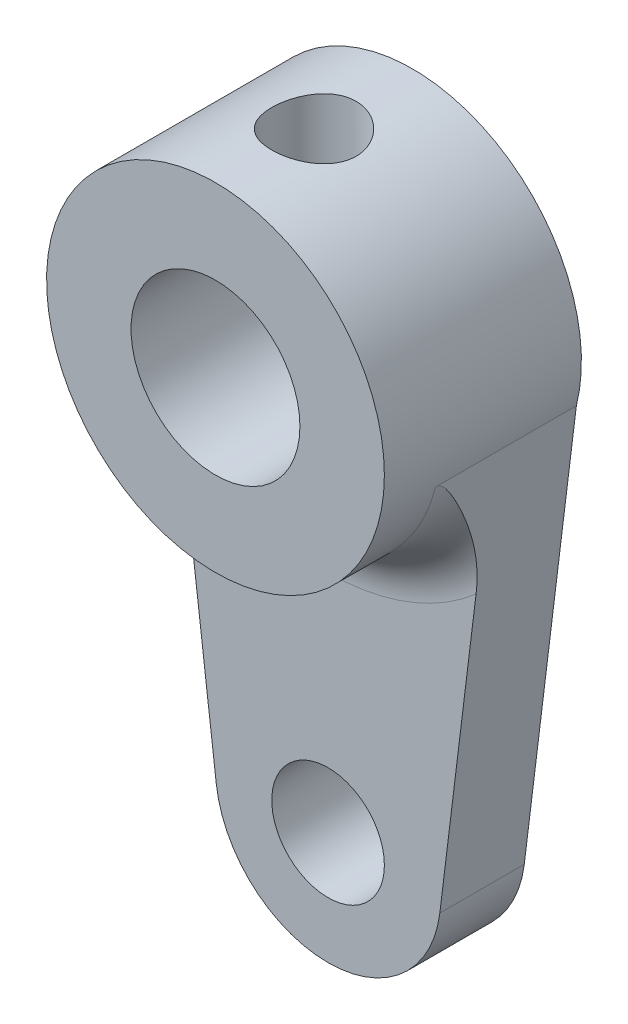
ISO-10303-21;
HEADER;
FILE_DESCRIPTION(('STEP AP214'),'2;1');
FILE_NAME('part.step','',(''),(''),'','','');
FILE_SCHEMA(('AUTOMOTIVE_DESIGN { 1 0 10303 214 1 1 1 1 }'));
ENDSEC;
DATA;
#1=APPLICATION_CONTEXT('core data for automotive mechanical design processes');
#2=APPLICATION_PROTOCOL_DEFINITION('international standard','automotive_design',2000,#1);
#3=PRODUCT_CONTEXT('',#1,'mechanical');
#4=PRODUCT('Part','Part','',(#3));
#5=PRODUCT_RELATED_PRODUCT_CATEGORY('part','',(#4));
#6=PRODUCT_DEFINITION_FORMATION('','',#4);
#7=PRODUCT_DEFINITION_CONTEXT('part definition',#1,'design');
#8=PRODUCT_DEFINITION('design','',#6,#7);
#9=PRODUCT_DEFINITION_SHAPE('','',#8);
#10=(LENGTH_UNIT() NAMED_UNIT(*) SI_UNIT(.MILLI.,.METRE.));
#11=(NAMED_UNIT(*) PLANE_ANGLE_UNIT() SI_UNIT($,.RADIAN.));
#12=(NAMED_UNIT(*) SI_UNIT($,.STERADIAN.) SOLID_ANGLE_UNIT());
#13=UNCERTAINTY_MEASURE_WITH_UNIT(LENGTH_MEASURE(1.E-05),#10,'distance_accuracy_value','');
#14=(GEOMETRIC_REPRESENTATION_CONTEXT(3) GLOBAL_UNCERTAINTY_ASSIGNED_CONTEXT((#13)) GLOBAL_UNIT_ASSIGNED_CONTEXT((#10,
#11,#12)) REPRESENTATION_CONTEXT('',''));
#15=CARTESIAN_POINT('',(0.,0.,0.));
#16=DIRECTION('',(0.,0.,1.));
#17=DIRECTION('',(1.,0.,0.));
#18=AXIS2_PLACEMENT_3D('',#15,#16,#17);
#19=CARTESIAN_POINT('',(0.,0.,7.));
#20=DIRECTION('',(0.,0.,-1.));
#21=DIRECTION('',(-1.,0.,0.));
#22=AXIS2_PLACEMENT_3D('',#19,#20,#21);
#23=CYLINDRICAL_SURFACE('',#22,6.);
#24=CARTESIAN_POINT('',(0.,6.,4.99999999999999));
#25=CARTESIAN_POINT('',(-0.0828760886697317,5.99999859868013,4.99999767426184));
#26=CARTESIAN_POINT('',(-0.165778157830763,5.99826578131828,4.99310844922621));
#27=CARTESIAN_POINT('',(-0.329206323770532,5.99152113829892,4.96577484869299));
#28=CARTESIAN_POINT('',(-0.409731046870738,5.98650745419968,4.94532279046215));
#29=CARTESIAN_POINT('',(-0.566020872182576,5.9737562633204,4.89156074653791));
#30=CARTESIAN_POINT('',(-0.641791563430001,5.96602202842087,4.85826620128472));
#31=CARTESIAN_POINT('',(-0.786672131904424,5.94865343807593,4.77981860995516));
#32=CARTESIAN_POINT('',(-0.855781784348756,5.9390190185405,4.73466516388106));
#33=CARTESIAN_POINT('',(-0.986801927300916,5.91867413591801,4.63279921034578));
#34=CARTESIAN_POINT('',(-1.04855569006107,5.90794707148533,4.57588842504082));
#35=CARTESIAN_POINT('',(-1.1617489272033,5.8867362011753,4.45254779509108));
#36=CARTESIAN_POINT('',(-1.21318723694913,5.87625242288349,4.3861168770535));
#37=CARTESIAN_POINT('',(-1.30502654279903,5.8565477569971,4.24440477326256));
#38=CARTESIAN_POINT('',(-1.34525221592535,5.84734794470605,4.16900676918959));
#39=CARTESIAN_POINT('',(-1.41239690855052,5.83149494812223,4.01225158834164));
#40=CARTESIAN_POINT('',(-1.43931805543933,5.82484135672789,3.93089536667424));
#41=CARTESIAN_POINT('',(-1.47855483680428,5.81500476717551,3.76625650179753));
#42=CARTESIAN_POINT('',(-1.49115226833333,5.81175491075426,3.6830451039502));
#43=CARTESIAN_POINT('',(-1.50226177506785,5.80889362537741,3.51563143098602));
#44=CARTESIAN_POINT('',(-1.50077614181797,5.80928160448644,3.43142931930139));
#45=CARTESIAN_POINT('',(-1.48398652463927,5.81359205496618,3.26658419225552));
#46=CARTESIAN_POINT('',(-1.46901834019051,5.81742863001879,3.1859043785349));
#47=CARTESIAN_POINT('',(-1.4262241869031,5.82806709676484,3.02823894908871));
#48=CARTESIAN_POINT('',(-1.39839730206942,5.83486919970697,2.95125359697102));
#49=CARTESIAN_POINT('',(-1.33038947793715,5.85075113904187,2.80226198374794));
#50=CARTESIAN_POINT('',(-1.29008666723291,5.85985327469421,2.73031382821045));
#51=CARTESIAN_POINT('',(-1.19835627601495,5.87929710846386,2.59408129024317));
#52=CARTESIAN_POINT('',(-1.14692674880884,5.88963902334735,2.52979825193275));
#53=CARTESIAN_POINT('',(-1.03266342468121,5.91075880539781,2.40879638430561));
#54=CARTESIAN_POINT('',(-0.969546258165856,5.92154069477971,2.35234550993865));
#55=CARTESIAN_POINT('',(-0.834611917503697,5.94205965578786,2.2507787575361));
#56=CARTESIAN_POINT('',(-0.762794477707941,5.95179669549415,2.20566322573644));
#57=CARTESIAN_POINT('',(-0.61211588868139,5.96917732094183,2.12794941377562));
#58=CARTESIAN_POINT('',(-0.533231393208622,5.97681360127725,2.09539465974558));
#59=CARTESIAN_POINT('',(-0.370876008142882,5.98907916991419,2.04408269429043));
#60=CARTESIAN_POINT('',(-0.287405999150484,5.99370903339281,2.02532284358187));
#61=CARTESIAN_POINT('',(-0.120539970390027,5.99935499271375,2.00254243444117));
#62=CARTESIAN_POINT('',(-0.03719671998821,6.00046053508279,1.99815697392471));
#63=CARTESIAN_POINT('',(0.129032874801507,5.99918804814451,2.00324900205549));
#64=CARTESIAN_POINT('',(0.211919259644594,5.99681033241847,2.01272524279914));
#65=CARTESIAN_POINT('',(0.373614268776489,5.98889581127357,2.04497090839139));
#66=CARTESIAN_POINT('',(0.452465118968752,5.98340634185811,2.06754126347699));
#67=CARTESIAN_POINT('',(0.605257292452508,5.96988706634134,2.12510708402845));
#68=CARTESIAN_POINT('',(0.679198119032631,5.96185700369892,2.16010380431318));
#69=CARTESIAN_POINT('',(0.821523134429843,5.9439330792631,2.24223612887473));
#70=CARTESIAN_POINT('',(0.889785441835826,5.93400867366932,2.28957611239677));
#71=CARTESIAN_POINT('',(1.01752661364324,5.91344509187419,2.39478990879698));
#72=CARTESIAN_POINT('',(1.077003958973,5.90280579251705,2.45266553961691));
#73=CARTESIAN_POINT('',(1.18699056807272,5.88168956960771,2.57900196084447));
#74=CARTESIAN_POINT('',(1.23724386762203,5.87122304187281,2.64768770300243));
#75=CARTESIAN_POINT('',(1.32551075901269,5.85192878377239,2.79273263446572));
#76=CARTESIAN_POINT('',(1.36352489415793,5.84310098067026,2.86909148295976));
#77=CARTESIAN_POINT('',(1.42595142060928,5.82818094734665,3.02690572241308));
#78=CARTESIAN_POINT('',(1.45044439665406,5.82207255291906,3.10832762834401));
#79=CARTESIAN_POINT('',(1.48534565995377,5.81326744090184,3.27430963788911));
#80=CARTESIAN_POINT('',(1.49575702747865,5.81056997719936,3.35886905103249));
#81=CARTESIAN_POINT('',(1.50203859033399,5.80894901203957,3.5261210238552));
#82=CARTESIAN_POINT('',(1.49831789778011,5.80991932728264,3.60879743512473));
#83=CARTESIAN_POINT('',(1.47737727831286,5.81527909007843,3.77230388866798));
#84=CARTESIAN_POINT('',(1.46015762268676,5.81966846891857,3.85313396801365));
#85=CARTESIAN_POINT('',(1.41293131944279,5.83131260682723,4.01020845906541));
#86=CARTESIAN_POINT('',(1.38300140468037,5.8385501523631,4.08647730524021));
#87=CARTESIAN_POINT('',(1.31126491360506,5.85507755724829,4.23296538271369));
#88=CARTESIAN_POINT('',(1.26945669003418,5.86436770120773,4.30318377318691));
#89=CARTESIAN_POINT('',(1.17386774863713,5.88425634263512,4.43755462900202));
#90=CARTESIAN_POINT('',(1.11980316291225,5.89488264831757,4.50150107342396));
#91=CARTESIAN_POINT('',(1.00178937118973,5.91608027246286,4.6195470447954));
#92=CARTESIAN_POINT('',(0.93783782126114,5.9266515772706,4.67364423011296));
#93=CARTESIAN_POINT('',(0.800467586702585,5.94677655647663,4.7714113085646));
#94=CARTESIAN_POINT('',(0.726898422316382,5.95630833365868,4.81487461367157));
#95=CARTESIAN_POINT('',(0.573266059510472,5.97304924975119,4.88874746294052));
#96=CARTESIAN_POINT('',(0.493207563436735,5.98026005199781,4.91916636064853));
#97=CARTESIAN_POINT('',(0.344410253243468,5.99048059565542,4.96157183032965));
#98=CARTESIAN_POINT('',(0.276380170908066,5.99402585052691,4.97595124305343));
#99=CARTESIAN_POINT('',(0.138906071536281,5.99878605231948,4.99516594362194));
#100=CARTESIAN_POINT('',(0.069462161242615,6.00000117450894,5.0000019493053));
#101=CARTESIAN_POINT('',(0.,6.,4.99999999999999));
#102=B_SPLINE_CURVE_WITH_KNOTS('',3,(#24,#25,#26,#27,#28,#29,#30,#31,#32,#33,#34,#35,#36,#37,
#38,#39,#40,#41,#42,#43,#44,#45,#46,#47,#48,#49,#50,#51,#52,#53,#54,#55,#56,#57,#58,#59,#60,#61,
#62,#63,#64,#65,#66,#67,#68,#69,#70,#71,#72,#73,#74,#75,#76,#77,#78,#79,#80,#81,#82,#83,#84,#85,
#86,#87,#88,#89,#90,#91,#92,#93,#94,#95,#96,#97,#98,#99,#100,#101),.UNSPECIFIED.,.T.,.F.,(4,2,2,
2,2,2,2,2,2,2,2,2,2,2,2,2,2,2,2,2,2,2,2,2,2,2,2,2,2,2,2,2,2,2,2,2,2,2,4),(0.,0.248373712471889,
0.496888237763897,0.745104902286103,0.993329940169324,1.24614435437139,1.49898729580061,
1.75558647545806,2.01214461169367,2.26356295099429,2.51494038112696,2.76022497007017,
3.00552703466037,3.25330527873878,3.50112690836161,3.75601500969018,4.01091089558245,
4.26668229009112,4.52240473688641,4.77158308949274,5.02073901112741,5.26620274514035,
5.51169127322288,5.76153587565349,6.01142363008016,6.26744509204473,6.52345518749505,
6.77792254614033,7.03233423252405,7.27943780398609,7.52653640956031,7.77216400559444,
8.01782568136898,8.26989576409907,8.52202569770414,8.77872185499584,9.03523363821346,
9.24342242942145,9.45159556043036),.UNSPECIFIED.);
#103=CARTESIAN_POINT('',(0.,6.,4.99999999999999));
#104=VERTEX_POINT('',#103);
#105=EDGE_CURVE('E110',#104,#104,#102,.T.);
#106=ORIENTED_EDGE('',*,*,#105,.T.);
#107=EDGE_LOOP('',(#106));
#108=FACE_BOUND('',#107,.T.);
#109=CARTESIAN_POINT('',(0.,0.,7.));
#110=DIRECTION('',(0.,0.,1.));
#111=DIRECTION('',(1.,0.,0.));
#112=AXIS2_PLACEMENT_3D('',#109,#110,#111);
#113=CIRCLE('',#112,6.);
#114=CARTESIAN_POINT('',(6.,0.,7.));
#115=VERTEX_POINT('',#114);
#116=EDGE_CURVE('E199',#115,#115,#113,.T.);
#117=ORIENTED_EDGE('',*,*,#116,.F.);
#118=EDGE_LOOP('',(#117));
#119=FACE_BOUND('',#118,.T.);
#120=CARTESIAN_POINT('',(0.,0.,5.));
#121=DIRECTION('',(0.,0.,1.));
#122=DIRECTION('',(1.,0.,0.));
#123=AXIS2_PLACEMENT_3D('',#120,#121,#122);
#124=CIRCLE('',#123,6.);
#125=CARTESIAN_POINT('',(-5.82083518297647,-1.45529301950613,5.));
#126=VERTEX_POINT('',#125);
#127=CARTESIAN_POINT('',(5.82083518297647,-1.45529301950613,5.));
#128=VERTEX_POINT('',#127);
#129=EDGE_CURVE('E202',#126,#128,#124,.T.);
#130=ORIENTED_EDGE('',*,*,#129,.T.);
#131=DIRECTION('',(0.,0.,-1.));
#132=VECTOR('',#131,1.);
#133=CARTESIAN_POINT('',(5.82083518297647,-1.45529301950613,3.));
#134=LINE('',#133,#132);
#135=CARTESIAN_POINT('',(5.82083518297647,-1.45529301950613,0.));
#136=VERTEX_POINT('',#135);
#137=EDGE_CURVE('E172',#128,#136,#134,.T.);
#138=ORIENTED_EDGE('',*,*,#137,.T.);
#139=CARTESIAN_POINT('',(0.,0.,0.));
#140=DIRECTION('',(0.,0.,1.));
#141=DIRECTION('',(1.,0.,0.));
#142=AXIS2_PLACEMENT_3D('',#139,#140,#141);
#143=CIRCLE('',#142,6.);
#144=CARTESIAN_POINT('',(-5.82083518297647,-1.45529301950613,0.));
#145=VERTEX_POINT('',#144);
#146=EDGE_CURVE('E171',#136,#145,#143,.T.);
#147=ORIENTED_EDGE('',*,*,#146,.T.);
#148=DIRECTION('',(0.,0.,-1.));
#149=VECTOR('',#148,1.);
#150=CARTESIAN_POINT('',(-5.82083518297647,-1.45529301950613,3.));
#151=LINE('',#150,#149);
#152=EDGE_CURVE('E194',#126,#145,#151,.T.);
#153=ORIENTED_EDGE('',*,*,#152,.F.);
#154=EDGE_LOOP('',(#130,#138,#147,#153));
#155=FACE_BOUND('',#154,.T.);
#156=ADVANCED_FACE('F105',(#108,#119,#155),#23,.T.);
#157=CARTESIAN_POINT('',(0.,0.,7.));
#158=DIRECTION('',(0.,0.,1.));
#159=DIRECTION('',(1.,0.,0.));
#160=AXIS2_PLACEMENT_3D('',#157,#158,#159);
#161=PLANE('',#160);
#162=CARTESIAN_POINT('',(0.,0.,7.));
#163=DIRECTION('',(0.,0.,1.));
#164=DIRECTION('',(1.,0.,0.));
#165=AXIS2_PLACEMENT_3D('',#162,#163,#164);
#166=CIRCLE('',#165,3.);
#167=CARTESIAN_POINT('',(3.,0.,7.));
#168=VERTEX_POINT('',#167);
#169=EDGE_CURVE('E187',#168,#168,#166,.T.);
#170=ORIENTED_EDGE('',*,*,#169,.F.);
#171=EDGE_LOOP('',(#170));
#172=FACE_BOUND('',#171,.T.);
#173=ORIENTED_EDGE('',*,*,#116,.T.);
#174=EDGE_LOOP('',(#173));
#175=FACE_BOUND('',#174,.T.);
#176=ADVANCED_FACE('F230',(#172,#175),#161,.T.);
#177=CARTESIAN_POINT('',(0.,0.,0.));
#178=DIRECTION('',(0.,0.,1.));
#179=DIRECTION('',(1.,0.,0.));
#180=AXIS2_PLACEMENT_3D('',#177,#178,#179);
#181=PLANE('',#180);
#182=CARTESIAN_POINT('',(0.,0.,0.));
#183=DIRECTION('',(0.,0.,1.));
#184=DIRECTION('',(1.,0.,0.));
#185=AXIS2_PLACEMENT_3D('',#182,#183,#184);
#186=CIRCLE('',#185,3.);
#187=CARTESIAN_POINT('',(3.,0.,0.));
#188=VERTEX_POINT('',#187);
#189=EDGE_CURVE('E280',#188,#188,#186,.T.);
#190=ORIENTED_EDGE('',*,*,#189,.T.);
#191=EDGE_LOOP('',(#190));
#192=FACE_BOUND('',#191,.T.);
#193=ORIENTED_EDGE('',*,*,#146,.F.);
#194=DIRECTION('',(-0.122190021763757,-0.992506724703351,0.));
#195=VECTOR('',#194,1.);
#196=CARTESIAN_POINT('',(5.91041759148824,-0.727646509753063,0.));
#197=LINE('',#196,#195);
#198=CARTESIAN_POINT('',(3.9700268988134,-16.488760087055,0.));
#199=VERTEX_POINT('',#198);
#200=EDGE_CURVE('E189',#136,#199,#197,.T.);
#201=ORIENTED_EDGE('',*,*,#200,.T.);
#202=CARTESIAN_POINT('',(0.,-16.,0.));
#203=DIRECTION('',(0.,0.,1.));
#204=DIRECTION('',(1.,0.,0.));
#205=AXIS2_PLACEMENT_3D('',#202,#203,#204);
#206=CIRCLE('',#205,4.);
#207=CARTESIAN_POINT('',(-3.9700268988134,-16.488760087055,0.));
#208=VERTEX_POINT('',#207);
#209=EDGE_CURVE('E169',#199,#208,#206,.F.);
#210=ORIENTED_EDGE('',*,*,#209,.T.);
#211=DIRECTION('',(-0.122190021763757,0.992506724703351,0.));
#212=VECTOR('',#211,1.);
#213=CARTESIAN_POINT('',(-5.91041759148824,-0.727646509753063,0.));
#214=LINE('',#213,#212);
#215=EDGE_CURVE('E178',#208,#145,#214,.T.);
#216=ORIENTED_EDGE('',*,*,#215,.T.);
#217=EDGE_LOOP('',(#193,#201,#210,#216));
#218=FACE_BOUND('',#217,.T.);
#219=CARTESIAN_POINT('',(0.,-16.,0.));
#220=DIRECTION('',(0.,0.,1.));
#221=DIRECTION('',(1.,0.,0.));
#222=AXIS2_PLACEMENT_3D('',#219,#220,#221);
#223=CIRCLE('',#222,2.);
#224=CARTESIAN_POINT('',(2.,-16.,0.));
#225=VERTEX_POINT('',#224);
#226=EDGE_CURVE('E184',#225,#225,#223,.T.);
#227=ORIENTED_EDGE('',*,*,#226,.T.);
#228=EDGE_LOOP('',(#227));
#229=FACE_BOUND('',#228,.T.);
#230=ADVANCED_FACE('F226',(#192,#218,#229),#181,.F.);
#231=CARTESIAN_POINT('',(0.,-16.,3.));
#232=DIRECTION('',(0.,0.,-1.));
#233=DIRECTION('',(-1.,0.,0.));
#234=AXIS2_PLACEMENT_3D('',#231,#232,#233);
#235=CYLINDRICAL_SURFACE('',#234,4.);
#236=ORIENTED_EDGE('',*,*,#209,.F.);
#237=DIRECTION('',(0.,0.,-1.));
#238=VECTOR('',#237,1.);
#239=CARTESIAN_POINT('',(3.9700268988134,-16.488760087055,3.));
#240=LINE('',#239,#238);
#241=CARTESIAN_POINT('',(3.9700268988134,-16.488760087055,3.));
#242=VERTEX_POINT('',#241);
#243=EDGE_CURVE('E159',#242,#199,#240,.T.);
#244=ORIENTED_EDGE('',*,*,#243,.F.);
#245=CARTESIAN_POINT('',(0.,-16.,3.));
#246=DIRECTION('',(0.,0.,1.));
#247=DIRECTION('',(1.,0.,0.));
#248=AXIS2_PLACEMENT_3D('',#245,#246,#247);
#249=CIRCLE('',#248,4.);
#250=CARTESIAN_POINT('',(-3.9700268988134,-16.488760087055,3.));
#251=VERTEX_POINT('',#250);
#252=EDGE_CURVE('E163',#242,#251,#249,.F.);
#253=ORIENTED_EDGE('',*,*,#252,.T.);
#254=DIRECTION('',(0.,0.,-1.));
#255=VECTOR('',#254,1.);
#256=CARTESIAN_POINT('',(-3.9700268988134,-16.488760087055,3.));
#257=LINE('',#256,#255);
#258=EDGE_CURVE('E183',#251,#208,#257,.T.);
#259=ORIENTED_EDGE('',*,*,#258,.T.);
#260=EDGE_LOOP('',(#236,#244,#253,#259));
#261=FACE_BOUND('',#260,.T.);
#262=ADVANCED_FACE('F167',(#261),#235,.T.);
#263=CARTESIAN_POINT('',(5.91041759148824,-0.727646509753063,3.));
#264=DIRECTION('',(0.992506724703351,-0.122190021763757,0.));
#265=DIRECTION('',(0.122190021763757,0.992506724703351,0.));
#266=AXIS2_PLACEMENT_3D('',#263,#264,#265);
#267=PLANE('',#266);
#268=ORIENTED_EDGE('',*,*,#200,.F.);
#269=ORIENTED_EDGE('',*,*,#137,.F.);
#270=CARTESIAN_POINT('',(5.82083518297647,-1.45529301950613,5.));
#271=CARTESIAN_POINT('',(5.82084515424474,-1.45521202638847,4.98225469603654));
#272=CARTESIAN_POINT('',(5.82059921711505,-1.45720968750311,4.96465873165724));
#273=CARTESIAN_POINT('',(5.81970417511761,-1.4644797999765,4.93057642629865));
#274=CARTESIAN_POINT('',(5.81906465993716,-1.46967435766609,4.91407374060407));
#275=CARTESIAN_POINT('',(5.81715864293262,-1.48515626582107,4.8755832651294));
#276=CARTESIAN_POINT('',(5.81574267130931,-1.49665770708313,4.85411350311163));
#277=CARTESIAN_POINT('',(5.81253570498767,-1.52270677061704,4.81289566627023));
#278=CARTESIAN_POINT('',(5.81074047285773,-1.53728881206077,4.79317095761927));
#279=CARTESIAN_POINT('',(5.80496011726722,-1.58424061476888,4.73554095704423));
#280=CARTESIAN_POINT('',(5.80063389138165,-1.61938103149058,4.69998303600393));
#281=CARTESIAN_POINT('',(5.79159559834205,-1.69279591833782,4.63226022960633));
#282=CARTESIAN_POINT('',(5.78688197396083,-1.731083037274,4.60011035975973));
#283=CARTESIAN_POINT('',(5.77720885606746,-1.80965438393094,4.53778589019904));
#284=CARTESIAN_POINT('',(5.77224785546768,-1.84995085319628,4.50762692240613));
#285=CARTESIAN_POINT('',(5.76220460846825,-1.93152862886824,4.44890899686726));
#286=CARTESIAN_POINT('',(5.75712264067642,-1.9728076722411,4.42034679020156));
#287=CARTESIAN_POINT('',(5.7418467017081,-2.09688877095412,4.33692808940148));
#288=CARTESIAN_POINT('',(5.7315194109357,-2.18077373464939,4.28370814033736));
#289=CARTESIAN_POINT('',(5.7106410271297,-2.35036152937496,4.18027680706605));
#290=CARTESIAN_POINT('',(5.70008986325951,-2.43606493578618,4.13006639493567));
#291=CARTESIAN_POINT('',(5.67879166090764,-2.60906276943245,4.03214661485263));
#292=CARTESIAN_POINT('',(5.66804431749903,-2.69635967348222,3.98444168446237));
#293=CARTESIAN_POINT('',(5.6463929411428,-2.87222621579432,3.8915198361589));
#294=CARTESIAN_POINT('',(5.63548893155993,-2.96079566427314,3.84630255200455));
#295=CARTESIAN_POINT('',(5.60274692945124,-3.22674747280915,3.71523263792304));
#296=CARTESIAN_POINT('',(5.5806853269835,-3.40594613805945,3.63307360722455));
#297=CARTESIAN_POINT('',(5.53599016303032,-3.76898929121487,3.48026589440504));
#298=CARTESIAN_POINT('',(5.51335706019915,-3.95283005363225,3.40960830101865));
#299=CARTESIAN_POINT('',(5.47180250064788,-4.29036317787099,3.29406904386992));
#300=CARTESIAN_POINT('',(5.45297918956127,-4.44325833710716,3.24683821322493));
#301=CARTESIAN_POINT('',(5.41498360741854,-4.75188313511716,3.16314120686789));
#302=CARTESIAN_POINT('',(5.39581149342695,-4.90761149811085,3.12667030743209));
#303=CARTESIAN_POINT('',(5.35693344201739,-5.2234042847097,3.06597848943191));
#304=CARTESIAN_POINT('',(5.33722386740774,-5.38349825194824,3.04190845213735));
#305=CARTESIAN_POINT('',(5.30749930613805,-5.62494044602573,3.01716708022195));
#306=CARTESIAN_POINT('',(5.29755294284231,-5.70573126932593,3.0108131643036));
#307=CARTESIAN_POINT('',(5.27762960747476,-5.8675615402874,3.00223052860551));
#308=CARTESIAN_POINT('',(5.26765262386398,-5.94860108167562,3.00000362452181));
#309=CARTESIAN_POINT('',(5.25767242862885,-6.029666709963,3.));
#310=B_SPLINE_CURVE_WITH_KNOTS('',3,(#270,#271,#272,#273,#274,#275,#276,#277,#278,#279,#280,
#281,#282,#283,#284,#285,#286,#287,#288,#289,#290,#291,#292,#293,#294,#295,#296,#297,#298,#299,
#300,#301,#302,#303,#304,#305,#306,#307,#308,#309),.UNSPECIFIED.,.F.,.F.,(4,2,2,2,2,2,2,2,2,2,2,
2,2,2,2,2,2,2,2,4),(0.,0.0528858887103809,0.104531582620345,0.177305839063999,0.250940817280566,
0.400900573676588,0.551495745147263,0.703159326586424,0.854502159499087,1.15402730956808,
1.45364869025841,1.75378398791321,2.05387497955814,2.64861418191146,3.24289036660256,
3.72594114613889,4.20877954462667,4.69736157980726,4.9422137387211,5.18717359581151),.UNSPECIFIED.);
#311=CARTESIAN_POINT('',(5.25767242862884,-6.029666709963,3.));
#312=VERTEX_POINT('',#311);
#313=EDGE_CURVE('E119',#128,#312,#310,.T.);
#314=ORIENTED_EDGE('',*,*,#313,.T.);
#315=DIRECTION('',(-0.122190021763757,-0.992506724703351,0.));
#316=VECTOR('',#315,1.);
#317=CARTESIAN_POINT('',(5.91041759148824,-0.727646509753063,3.));
#318=LINE('',#317,#316);
#319=EDGE_CURVE('E155',#312,#242,#318,.T.);
#320=ORIENTED_EDGE('',*,*,#319,.T.);
#321=ORIENTED_EDGE('',*,*,#243,.T.);
#322=EDGE_LOOP('',(#268,#269,#314,#320,#321));
#323=FACE_BOUND('',#322,.T.);
#324=ADVANCED_FACE('F158',(#323),#267,.T.);
#325=CARTESIAN_POINT('',(0.,-16.,3.));
#326=DIRECTION('',(0.,0.,-1.));
#327=DIRECTION('',(-1.,0.,0.));
#328=AXIS2_PLACEMENT_3D('',#325,#326,#327);
#329=CYLINDRICAL_SURFACE('',#328,2.);
#330=CARTESIAN_POINT('',(0.,-16.,3.));
#331=DIRECTION('',(0.,0.,1.));
#332=DIRECTION('',(1.,0.,0.));
#333=AXIS2_PLACEMENT_3D('',#330,#331,#332);
#334=CIRCLE('',#333,2.);
#335=CARTESIAN_POINT('',(2.,-16.,3.));
#336=VERTEX_POINT('',#335);
#337=EDGE_CURVE('E175',#336,#336,#334,.T.);
#338=ORIENTED_EDGE('',*,*,#337,.T.);
#339=EDGE_LOOP('',(#338));
#340=FACE_BOUND('',#339,.T.);
#341=ORIENTED_EDGE('',*,*,#226,.F.);
#342=EDGE_LOOP('',(#341));
#343=FACE_BOUND('',#342,.T.);
#344=ADVANCED_FACE('F220',(#340,#343),#329,.F.);
#345=CARTESIAN_POINT('',(-5.91041759148824,-0.727646509753063,3.));
#346=DIRECTION('',(-0.992506724703351,-0.122190021763757,0.));
#347=DIRECTION('',(0.122190021763757,-0.992506724703351,0.));
#348=AXIS2_PLACEMENT_3D('',#345,#346,#347);
#349=PLANE('',#348);
#350=ORIENTED_EDGE('',*,*,#215,.F.);
#351=ORIENTED_EDGE('',*,*,#258,.F.);
#352=DIRECTION('',(-0.122190021763757,0.992506724703351,0.));
#353=VECTOR('',#352,1.);
#354=CARTESIAN_POINT('',(-5.91041759148824,-0.727646509753063,3.));
#355=LINE('',#354,#353);
#356=CARTESIAN_POINT('',(-5.25767242862884,-6.029666709963,3.));
#357=VERTEX_POINT('',#356);
#358=EDGE_CURVE('E162',#251,#357,#355,.T.);
#359=ORIENTED_EDGE('',*,*,#358,.T.);
#360=CARTESIAN_POINT('',(-5.25767242862885,-6.029666709963,3.));
#361=CARTESIAN_POINT('',(-5.2756381635308,-5.88373734153302,3.00003673601835));
#362=CARTESIAN_POINT('',(-5.29358403327924,-5.73796933078328,3.00722388604491));
#363=CARTESIAN_POINT('',(-5.32930465022428,-5.44782327780149,3.03414551514986));
#364=CARTESIAN_POINT('',(-5.34707964943553,-5.30344318854291,3.05385713244223));
#365=CARTESIAN_POINT('',(-5.38227480779299,-5.01756525151859,3.10391846928308));
#366=CARTESIAN_POINT('',(-5.3996965473949,-4.87605456626512,3.13419594007964));
#367=CARTESIAN_POINT('',(-5.43426558313729,-4.59526240381532,3.20399456971143));
#368=CARTESIAN_POINT('',(-5.45141276709218,-4.45598183786324,3.24351940905127));
#369=CARTESIAN_POINT('',(-5.49046745416796,-4.13875430165051,3.34352365398838));
#370=CARTESIAN_POINT('',(-5.51227001901028,-3.96165970825055,3.40673718652471));
#371=CARTESIAN_POINT('',(-5.55535305317606,-3.61171132037951,3.54436348947847));
#372=CARTESIAN_POINT('',(-5.57663313573133,-3.43886066749081,3.61878428168535));
#373=CARTESIAN_POINT('',(-5.61251365428963,-3.14741578974284,3.75399747045386));
#374=CARTESIAN_POINT('',(-5.62724894408866,-3.02772619475883,3.81241783127487));
#375=CARTESIAN_POINT('',(-5.65644317270042,-2.79059170700404,3.93370324690899));
#376=CARTESIAN_POINT('',(-5.67090213619867,-2.6731466137214,3.99656790231231));
#377=CARTESIAN_POINT('',(-5.69482631486728,-2.47881889474033,4.10555187130641));
#378=CARTESIAN_POINT('',(-5.70437710109491,-2.40124120533244,4.15041774764474));
#379=CARTESIAN_POINT('',(-5.72330527843606,-2.24749425426153,4.24248652322841));
#380=CARTESIAN_POINT('',(-5.73268274038325,-2.17132441724137,4.28968843742492));
#381=CARTESIAN_POINT('',(-5.74801288202603,-2.04680304919928,4.37043936890807));
#382=CARTESIAN_POINT('',(-5.7540349951194,-1.99788753502045,4.4031055142162));
#383=CARTESIAN_POINT('',(-5.76593741158373,-1.9012083773401,4.47027434559706));
#384=CARTESIAN_POINT('',(-5.77181754378686,-1.85344612417483,4.50477910187567));
#385=CARTESIAN_POINT('',(-5.78265372080565,-1.76542765584178,4.57227549401547));
#386=CARTESIAN_POINT('',(-5.78763734442054,-1.72494742775297,4.60497115768737));
#387=CARTESIAN_POINT('',(-5.79726075238329,-1.64677985744138,4.6736409600566));
#388=CARTESIAN_POINT('',(-5.80190123828889,-1.60908681671097,4.7096080541844));
#389=CARTESIAN_POINT('',(-5.80795981769877,-1.55987509942291,4.76515896810449));
#390=CARTESIAN_POINT('',(-5.80970199416815,-1.5457240105163,4.78233628204319));
#391=CARTESIAN_POINT('',(-5.81295707451917,-1.51928413358362,4.81813139487015));
#392=CARTESIAN_POINT('',(-5.81447004250557,-1.506994824857,4.83674878878991));
#393=CARTESIAN_POINT('',(-5.81679654210765,-1.48809748392234,4.8708197610122));
#394=CARTESIAN_POINT('',(-5.81769035836246,-1.48083732772673,4.88589921152889));
#395=CARTESIAN_POINT('',(-5.81918320055082,-1.4687114938045,4.91697981108125));
#396=CARTESIAN_POINT('',(-5.81978347228055,-1.46383569691201,4.93297673730719));
#397=CARTESIAN_POINT('',(-5.82040399212571,-1.45879543167393,4.95760689168111));
#398=CARTESIAN_POINT('',(-5.82056432802211,-1.457493079378,4.96600895338992));
#399=CARTESIAN_POINT('',(-5.82078051329533,-1.45573708216676,4.98293789472737));
#400=CARTESIAN_POINT('',(-5.82083591698438,-1.45528705741712,4.99146515242496));
#401=CARTESIAN_POINT('',(-5.82083518297647,-1.45529301950613,5.));
#402=B_SPLINE_CURVE_WITH_KNOTS('',3,(#360,#361,#362,#363,#364,#365,#366,#367,#368,#369,#370,
#371,#372,#373,#374,#375,#376,#377,#378,#379,#380,#381,#382,#383,#384,#385,#386,#387,#388,#389,
#390,#391,#392,#393,#394,#395,#396,#397,#398,#399,#400,#401),.UNSPECIFIED.,.F.,.F.,(4,2,2,2,2,2,
2,2,2,2,2,2,2,2,2,2,2,2,2,2,4),(0.,0.440687387609318,0.880572659668365,1.31750712511422,
1.75461578965689,2.32204484848388,2.88988200201918,3.29179441649878,3.69367075682022,
3.96401637649379,4.23424895366016,4.41161086032408,4.58917687263949,4.74594949329912,
4.90239217623336,4.9692872563781,5.03616359270687,5.08630459112775,5.13623090454364,
5.16170223669528,5.18728151495099),.UNSPECIFIED.);
#403=EDGE_CURVE('E59',#357,#126,#402,.T.);
#404=ORIENTED_EDGE('',*,*,#403,.T.);
#405=ORIENTED_EDGE('',*,*,#152,.T.);
#406=EDGE_LOOP('',(#350,#351,#359,#404,#405));
#407=FACE_BOUND('',#406,.T.);
#408=ADVANCED_FACE('F221',(#407),#349,.T.);
#409=CARTESIAN_POINT('',(0.,0.,3.));
#410=DIRECTION('',(0.,0.,1.));
#411=DIRECTION('',(1.,0.,0.));
#412=AXIS2_PLACEMENT_3D('',#409,#410,#411);
#413=PLANE('',#412);
#414=ORIENTED_EDGE('',*,*,#337,.F.);
#415=EDGE_LOOP('',(#414));
#416=FACE_BOUND('',#415,.T.);
#417=ORIENTED_EDGE('',*,*,#319,.F.);
#418=CARTESIAN_POINT('',(0.,0.,3.));
#419=DIRECTION('',(0.,0.,1.));
#420=DIRECTION('',(1.,0.,0.));
#421=AXIS2_PLACEMENT_3D('',#418,#419,#420);
#422=CIRCLE('',#421,8.);
#423=EDGE_CURVE('E126',#312,#357,#422,.F.);
#424=ORIENTED_EDGE('',*,*,#423,.T.);
#425=ORIENTED_EDGE('',*,*,#358,.F.);
#426=ORIENTED_EDGE('',*,*,#252,.F.);
#427=EDGE_LOOP('',(#417,#424,#425,#426));
#428=FACE_BOUND('',#427,.T.);
#429=ADVANCED_FACE('F174',(#416,#428),#413,.T.);
#430=CARTESIAN_POINT('',(0.,0.,7.));
#431=DIRECTION('',(0.,0.,-1.));
#432=DIRECTION('',(-1.,0.,0.));
#433=AXIS2_PLACEMENT_3D('',#430,#431,#432);
#434=CYLINDRICAL_SURFACE('',#433,3.);
#435=CARTESIAN_POINT('',(0.,3.,4.99999999999999));
#436=CARTESIAN_POINT('',(-0.0788579444268507,2.99999570107562,4.99999504652421));
#437=CARTESIAN_POINT('',(-0.157809899546344,2.99685736529635,4.99374489031841));
#438=CARTESIAN_POINT('',(-0.313380352903344,2.98461234055736,4.96902067948769));
#439=CARTESIAN_POINT('',(-0.389994130070444,2.97549431743379,4.95052341050327));
#440=CARTESIAN_POINT('',(-0.538400317320672,2.95224419105063,4.90220928707505));
#441=CARTESIAN_POINT('',(-0.610210204408718,2.93813158766306,4.87243642362804));
#442=CARTESIAN_POINT('',(-0.747708925209896,2.90618664773642,4.80264406795252));
#443=CARTESIAN_POINT('',(-0.813398240985086,2.88835460450288,4.7626253836267));
#444=CARTESIAN_POINT('',(-0.941261726642861,2.84934387387093,4.67072412577207));
#445=CARTESIAN_POINT('',(-1.00298281668316,2.82802798691306,4.61827028114054));
#446=CARTESIAN_POINT('',(-1.11716916730047,2.78489955370115,4.50421778112944));
#447=CARTESIAN_POINT('',(-1.16962737466015,2.76308664313552,4.44261222234133));
#448=CARTESIAN_POINT('',(-1.26787800067541,2.71948426796021,4.30627497571492));
#449=CARTESIAN_POINT('',(-1.31283800332745,2.69782780455198,4.23089585248113));
#450=CARTESIAN_POINT('',(-1.38925234033604,2.65928968158481,4.07244899602068));
#451=CARTESIAN_POINT('',(-1.4207163224495,2.64240461410485,3.98938680691587));
#452=CARTESIAN_POINT('',(-1.46719866328288,2.61686800556713,3.82300234186711));
#453=CARTESIAN_POINT('',(-1.48308878562066,2.60778407375571,3.73999332189891));
#454=CARTESIAN_POINT('',(-1.50064048996326,2.59772834922792,3.57203174333078));
#455=CARTESIAN_POINT('',(-1.50231613255961,2.59674854014932,3.48708118869327));
#456=CARTESIAN_POINT('',(-1.49203093075844,2.60266395385873,3.32857096352695));
#457=CARTESIAN_POINT('',(-1.48167683930523,2.60863145493021,3.25486395316542));
#458=CARTESIAN_POINT('',(-1.45040977358539,2.62614343100776,3.11041713594044));
#459=CARTESIAN_POINT('',(-1.42949343584647,2.63768968247665,3.03967828204203));
#460=CARTESIAN_POINT('',(-1.377314670579,2.66531214619112,2.90115630115151));
#461=CARTESIAN_POINT('',(-1.34582260067399,2.68148760995998,2.83348040182132));
#462=CARTESIAN_POINT('',(-1.273562531502,2.71655106422106,2.70404856111499));
#463=CARTESIAN_POINT('',(-1.2327903657187,2.73544027170286,2.64229529659987));
#464=CARTESIAN_POINT('',(-1.13709908236918,2.77669736854929,2.51821812088516));
#465=CARTESIAN_POINT('',(-1.08104168755392,2.79920265355119,2.45681468963577));
#466=CARTESIAN_POINT('',(-0.959333368112056,2.84321434950611,2.34389687211365));
#467=CARTESIAN_POINT('',(-0.893677884861424,2.86472027938202,2.29238721194918));
#468=CARTESIAN_POINT('',(-0.750774758747769,2.90552980924446,2.19847150845541));
#469=CARTESIAN_POINT('',(-0.673130387399109,2.92468476243011,2.15659929133139));
#470=CARTESIAN_POINT('',(-0.510699323233192,2.95736821681864,2.08685445643549));
#471=CARTESIAN_POINT('',(-0.425918364397912,2.9709011841533,2.05897072247726));
#472=CARTESIAN_POINT('',(-0.259149737491052,2.98986500612153,2.02028689442499));
#473=CARTESIAN_POINT('',(-0.177512295822488,2.99587407451965,2.00826314637983));
#474=CARTESIAN_POINT('',(-0.0131693999240273,3.00109520188655,1.99780290329828));
#475=CARTESIAN_POINT('',(0.0695355298048628,3.00031048081978,1.9993599715408));
#476=CARTESIAN_POINT('',(0.226849457978979,2.99236788380152,2.01531003262812));
#477=CARTESIAN_POINT('',(0.301589112074894,2.98570868532253,2.028698799095));
#478=CARTESIAN_POINT('',(0.44761033845291,2.9673325697226,2.06635710784269));
#479=CARTESIAN_POINT('',(0.518891528536629,2.95561509501618,2.09062784968025));
#480=CARTESIAN_POINT('',(0.658332912674357,2.92776377120382,2.14999769964956));
#481=CARTESIAN_POINT('',(0.726345595508702,2.91151322654446,2.18538657517444));
#482=CARTESIAN_POINT('',(0.855692042548904,2.87615961476127,2.26566130346986));
#483=CARTESIAN_POINT('',(0.917022944664884,2.85705533350408,2.3105512018931));
#484=CARTESIAN_POINT('',(1.03765153393382,2.81562332004297,2.41364063799608));
#485=CARTESIAN_POINT('',(1.09615811672854,2.79316327265249,2.47271430266773));
#486=CARTESIAN_POINT('',(1.20278448167828,2.7489358741323,2.5998877269166));
#487=CARTESIAN_POINT('',(1.2508970785678,2.72716901100071,2.66799367827188));
#488=CARTESIAN_POINT('',(1.33756187171852,2.68576788309734,2.81546548125947));
#489=CARTESIAN_POINT('',(1.37553824370037,2.66628794383591,2.89521689914173));
#490=CARTESIAN_POINT('',(1.43712423890205,2.63361108441202,3.06126510136245));
#491=CARTESIAN_POINT('',(1.46075237380052,2.62040607332625,3.14755328970034));
#492=CARTESIAN_POINT('',(1.4907925312003,2.60342251538703,3.31536533432706));
#493=CARTESIAN_POINT('',(1.49863949460817,2.59886075197598,3.39655138015286));
#494=CARTESIAN_POINT('',(1.5010337315643,2.59748031962405,3.55917060074679));
#495=CARTESIAN_POINT('',(1.49558676993486,2.60065829439585,3.64060365310679));
#496=CARTESIAN_POINT('',(1.47288918838996,2.61356793076615,3.79322525230016));
#497=CARTESIAN_POINT('',(1.45681247151454,2.62264641723988,3.86465070521711));
#498=CARTESIAN_POINT('',(1.41476303733661,2.64556524281479,4.00371217913655));
#499=CARTESIAN_POINT('',(1.38878713673987,2.65940711354503,4.07134697313805));
#500=CARTESIAN_POINT('',(1.32572361795084,2.69142795546804,4.2059372764798));
#501=CARTESIAN_POINT('',(1.28800670672354,2.70983583593881,4.27254185274354));
#502=CARTESIAN_POINT('',(1.20322645745608,2.74852997452291,4.39891180427189));
#503=CARTESIAN_POINT('',(1.15615825686233,2.76881720693416,4.45867359578167));
#504=CARTESIAN_POINT('',(1.04730498999205,2.81193484737138,4.57721297353201));
#505=CARTESIAN_POINT('',(0.984426634495883,2.83477474959943,4.63498865352543));
#506=CARTESIAN_POINT('',(0.849232209349787,2.87816628389896,4.7393944751529));
#507=CARTESIAN_POINT('',(0.776911084957788,2.89871667939293,4.78601860920486));
#508=CARTESIAN_POINT('',(0.623897395174412,2.93547014349806,4.8668545440681));
#509=CARTESIAN_POINT('',(0.543149255665089,2.95164144740899,4.9009762538547));
#510=CARTESIAN_POINT('',(0.376113151707124,2.9775201194848,4.95471225163611));
#511=CARTESIAN_POINT('',(0.289841699383645,2.98724585044602,4.97436777020856));
#512=CARTESIAN_POINT('',(0.168902919736339,2.99543192870217,4.99084611662861));
#513=CARTESIAN_POINT('',(0.135242819162344,2.99714048010376,4.9942739612995));
#514=CARTESIAN_POINT('',(0.0677275977076357,2.99942545465223,4.99885199827112));
#515=CARTESIAN_POINT('',(0.0338724714699414,3.00000184655071,5.00000212770531));
#516=CARTESIAN_POINT('',(0.,3.,4.99999999999999));
#517=B_SPLINE_CURVE_WITH_KNOTS('',3,(#435,#436,#437,#438,#439,#440,#441,#442,#443,#444,#445,
#446,#447,#448,#449,#450,#451,#452,#453,#454,#455,#456,#457,#458,#459,#460,#461,#462,#463,#464,
#465,#466,#467,#468,#469,#470,#471,#472,#473,#474,#475,#476,#477,#478,#479,#480,#481,#482,#483,
#484,#485,#486,#487,#488,#489,#490,#491,#492,#493,#494,#495,#496,#497,#498,#499,#500,#501,#502,
#503,#504,#505,#506,#507,#508,#509,#510,#511,#512,#513,#514,#515,#516),.UNSPECIFIED.,.T.,.F.,(4,
2,2,2,2,2,2,2,2,2,2,2,2,2,2,2,2,2,2,2,2,2,2,2,2,2,2,2,2,2,2,2,2,2,2,2,2,2,2,2,4),(0.,
0.236436386130438,0.473322224563795,0.709293233238445,0.945245640872348,1.19547263807713,
1.44588935648105,1.71572589646128,1.98536921847421,2.23887018210343,2.4921203599353,
2.7150856861398,2.93812205888517,3.1663536025273,3.39468781890331,3.65197412000816,
3.90938301898028,4.17874533321659,4.44789325368417,4.69474935707017,4.94148846767212,
5.16910359759181,5.39674382446395,5.63089284041846,5.86514176122507,6.12239415966626,
6.37982382923145,6.64972023242586,6.91926767918173,7.16293961254567,7.40650589797015,
7.62686895373281,7.84730293182524,8.08254685170428,8.31791341715443,8.58187864135754,
8.84598575071865,9.11196020495286,9.3771736293172,9.47872920200871,9.58028757766595),.UNSPECIFIED.);
#518=CARTESIAN_POINT('',(0.,3.,4.99999999999999));
#519=VERTEX_POINT('',#518);
#520=EDGE_CURVE('E274',#519,#519,#517,.T.);
#521=ORIENTED_EDGE('',*,*,#520,.F.);
#522=EDGE_LOOP('',(#521));
#523=FACE_BOUND('',#522,.T.);
#524=ORIENTED_EDGE('',*,*,#169,.T.);
#525=EDGE_LOOP('',(#524));
#526=FACE_BOUND('',#525,.T.);
#527=ORIENTED_EDGE('',*,*,#189,.F.);
#528=EDGE_LOOP('',(#527));
#529=FACE_BOUND('',#528,.T.);
#530=ADVANCED_FACE('F261',(#523,#526,#529),#434,.F.);
#531=CARTESIAN_POINT('',(0.,0.,5.));
#532=DIRECTION('',(0.,0.,1.));
#533=DIRECTION('',(1.,0.,0.));
#534=AXIS2_PLACEMENT_3D('',#531,#532,#533);
#535=TOROIDAL_SURFACE('',#534,8.,2.);
#536=ORIENTED_EDGE('',*,*,#403,.F.);
#537=ORIENTED_EDGE('',*,*,#423,.F.);
#538=ORIENTED_EDGE('',*,*,#313,.F.);
#539=ORIENTED_EDGE('',*,*,#129,.F.);
#540=EDGE_LOOP('',(#536,#537,#538,#539));
#541=FACE_BOUND('',#540,.T.);
#542=ADVANCED_FACE('F107',(#541),#535,.F.);
#543=CARTESIAN_POINT('',(0.,7.,3.5));
#544=DIRECTION('',(0.,1.,0.));
#545=DIRECTION('',(0.,0.,1.));
#546=AXIS2_PLACEMENT_3D('',#543,#544,#545);
#547=CYLINDRICAL_SURFACE('',#546,1.49999999999999);
#548=ORIENTED_EDGE('',*,*,#520,.T.);
#549=EDGE_LOOP('',(#548));
#550=FACE_BOUND('',#549,.T.);
#551=ORIENTED_EDGE('',*,*,#105,.F.);
#552=EDGE_LOOP('',(#551));
#553=FACE_BOUND('',#552,.T.);
#554=ADVANCED_FACE('F271',(#550,#553),#547,.F.);
#555=CLOSED_SHELL('',(#156,#176,#230,#262,#324,#344,#408,#429,#530,#542,#554));
#556=MANIFOLD_SOLID_BREP('B6',#555);
#557=ADVANCED_BREP_SHAPE_REPRESENTATION('',(#18,#556),#14);
#558=SHAPE_DEFINITION_REPRESENTATION(#9,#557);
ENDSEC;
END-ISO-10303-21;
